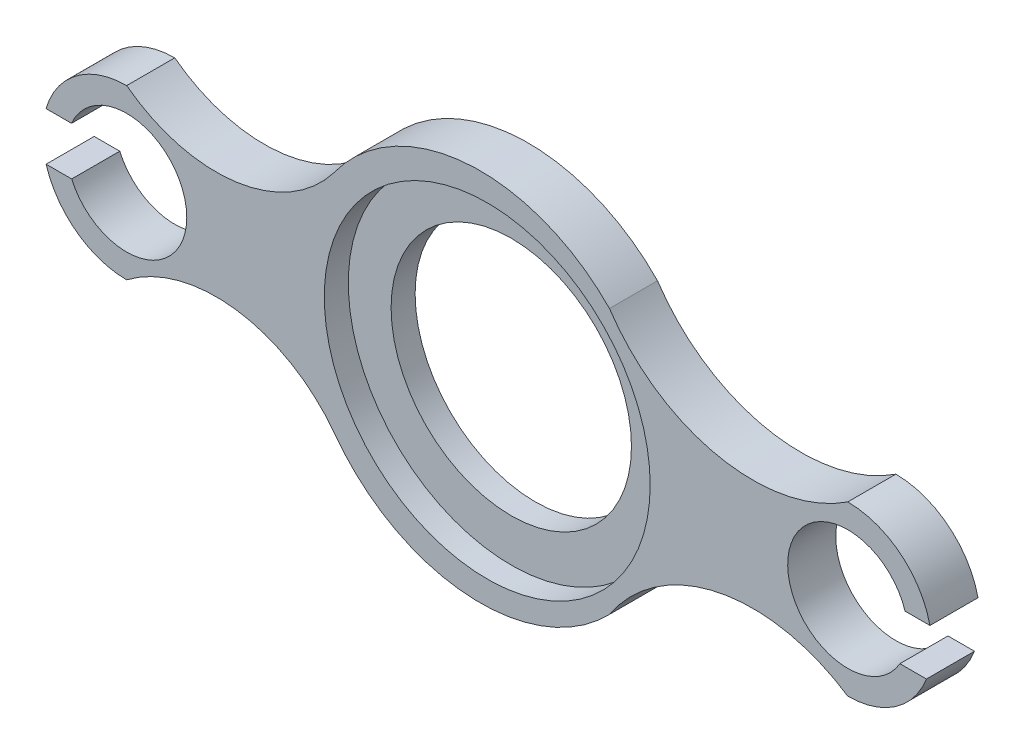
ISO-10303-21;
HEADER;
FILE_DESCRIPTION(('STEP AP214'),'2;1');
FILE_NAME('part.step','',(''),(''),'','','');
FILE_SCHEMA(('AUTOMOTIVE_DESIGN { 1 0 10303 214 1 1 1 1 }'));
ENDSEC;
DATA;
#1=APPLICATION_CONTEXT('core data for automotive mechanical design processes');
#2=APPLICATION_PROTOCOL_DEFINITION('international standard','automotive_design',2000,#1);
#3=PRODUCT_CONTEXT('',#1,'mechanical');
#4=PRODUCT('Part','Part','',(#3));
#5=PRODUCT_RELATED_PRODUCT_CATEGORY('part','',(#4));
#6=PRODUCT_DEFINITION_FORMATION('','',#4);
#7=PRODUCT_DEFINITION_CONTEXT('part definition',#1,'design');
#8=PRODUCT_DEFINITION('design','',#6,#7);
#9=PRODUCT_DEFINITION_SHAPE('','',#8);
#10=(LENGTH_UNIT() NAMED_UNIT(*) SI_UNIT(.MILLI.,.METRE.));
#11=(NAMED_UNIT(*) PLANE_ANGLE_UNIT() SI_UNIT($,.RADIAN.));
#12=(NAMED_UNIT(*) SI_UNIT($,.STERADIAN.) SOLID_ANGLE_UNIT());
#13=UNCERTAINTY_MEASURE_WITH_UNIT(LENGTH_MEASURE(1.E-05),#10,'distance_accuracy_value','');
#14=(GEOMETRIC_REPRESENTATION_CONTEXT(3) GLOBAL_UNCERTAINTY_ASSIGNED_CONTEXT((#13)) GLOBAL_UNIT_ASSIGNED_CONTEXT((#10,
#11,#12)) REPRESENTATION_CONTEXT('',''));
#15=CARTESIAN_POINT('',(0.,0.,0.));
#16=DIRECTION('',(0.,0.,1.));
#17=DIRECTION('',(1.,0.,0.));
#18=AXIS2_PLACEMENT_3D('',#15,#16,#17);
#19=CARTESIAN_POINT('',(150.,0.,20.));
#20=DIRECTION('',(0.,0.,-1.));
#21=DIRECTION('',(-1.,0.,0.));
#22=AXIS2_PLACEMENT_3D('',#19,#20,#21);
#23=CYLINDRICAL_SURFACE('',#22,35.);
#24=DIRECTION('',(0.,0.,-1.));
#25=VECTOR('',#24,1.);
#26=CARTESIAN_POINT('',(182.713610867677,-12.4426550220684,20.));
#27=LINE('',#26,#25);
#28=CARTESIAN_POINT('',(182.713610867677,-12.4426550220684,20.));
#29=VERTEX_POINT('',#28);
#30=CARTESIAN_POINT('',(182.713610867677,-12.4426550220684,0.));
#31=VERTEX_POINT('',#30);
#32=EDGE_CURVE('E57',#29,#31,#27,.T.);
#33=ORIENTED_EDGE('',*,*,#32,.F.);
#34=CARTESIAN_POINT('',(150.,0.,20.));
#35=DIRECTION('',(0.,0.,1.));
#36=DIRECTION('',(1.,0.,0.));
#37=AXIS2_PLACEMENT_3D('',#34,#35,#36);
#38=CIRCLE('',#37,35.);
#39=CARTESIAN_POINT('',(150.,-35.,20.));
#40=VERTEX_POINT('',#39);
#41=EDGE_CURVE('E181',#29,#40,#38,.F.);
#42=ORIENTED_EDGE('',*,*,#41,.T.);
#43=DIRECTION('',(0.,0.,-1.));
#44=VECTOR('',#43,1.);
#45=CARTESIAN_POINT('',(150.,-35.,20.));
#46=LINE('',#45,#44);
#47=CARTESIAN_POINT('',(150.,-35.,0.));
#48=VERTEX_POINT('',#47);
#49=EDGE_CURVE('E215',#40,#48,#46,.T.);
#50=ORIENTED_EDGE('',*,*,#49,.T.);
#51=CARTESIAN_POINT('',(150.,0.,0.));
#52=DIRECTION('',(0.,0.,1.));
#53=DIRECTION('',(1.,0.,0.));
#54=AXIS2_PLACEMENT_3D('',#51,#52,#53);
#55=CIRCLE('',#54,35.);
#56=EDGE_CURVE('E225',#31,#48,#55,.F.);
#57=ORIENTED_EDGE('',*,*,#56,.F.);
#58=EDGE_LOOP('',(#33,#42,#50,#57));
#59=FACE_BOUND('',#58,.T.);
#60=ADVANCED_FACE('F41',(#59),#23,.T.);
#61=CARTESIAN_POINT('',(-150.,0.,20.));
#62=DIRECTION('',(0.,0.,-1.));
#63=DIRECTION('',(-1.,0.,0.));
#64=AXIS2_PLACEMENT_3D('',#61,#62,#63);
#65=CYLINDRICAL_SURFACE('',#64,35.);
#66=CARTESIAN_POINT('',(-150.,0.,20.));
#67=DIRECTION('',(0.,0.,1.));
#68=DIRECTION('',(1.,0.,0.));
#69=AXIS2_PLACEMENT_3D('',#66,#67,#68);
#70=CIRCLE('',#69,35.);
#71=CARTESIAN_POINT('',(-183.518214525277,-10.0761746232141,20.));
#72=VERTEX_POINT('',#71);
#73=CARTESIAN_POINT('',(-150.,-35.,20.));
#74=VERTEX_POINT('',#73);
#75=EDGE_CURVE('E198',#72,#74,#70,.T.);
#76=ORIENTED_EDGE('',*,*,#75,.F.);
#77=DIRECTION('',(0.,0.,-1.));
#78=VECTOR('',#77,1.);
#79=CARTESIAN_POINT('',(-183.518214525277,-10.0761746232141,20.));
#80=LINE('',#79,#78);
#81=CARTESIAN_POINT('',(-183.518214525277,-10.0761746232141,0.));
#82=VERTEX_POINT('',#81);
#83=EDGE_CURVE('E320',#72,#82,#80,.T.);
#84=ORIENTED_EDGE('',*,*,#83,.T.);
#85=CARTESIAN_POINT('',(-150.,0.,0.));
#86=DIRECTION('',(0.,0.,1.));
#87=DIRECTION('',(1.,0.,0.));
#88=AXIS2_PLACEMENT_3D('',#85,#86,#87);
#89=CIRCLE('',#88,35.);
#90=CARTESIAN_POINT('',(-150.,-35.,0.));
#91=VERTEX_POINT('',#90);
#92=EDGE_CURVE('E241',#82,#91,#89,.T.);
#93=ORIENTED_EDGE('',*,*,#92,.T.);
#94=DIRECTION('',(0.,0.,-1.));
#95=VECTOR('',#94,1.);
#96=CARTESIAN_POINT('',(-150.,-35.,20.));
#97=LINE('',#96,#95);
#98=EDGE_CURVE('E268',#74,#91,#97,.T.);
#99=ORIENTED_EDGE('',*,*,#98,.F.);
#100=EDGE_LOOP('',(#76,#84,#93,#99));
#101=FACE_BOUND('',#100,.T.);
#102=ADVANCED_FACE('F360',(#101),#65,.T.);
#103=DIRECTION('',(0.,0.,-1.));
#104=VECTOR('',#103,1.);
#105=CARTESIAN_POINT('',(184.174354959304,7.55734497793156,20.));
#106=LINE('',#105,#104);
#107=CARTESIAN_POINT('',(184.174354959304,7.55734497793156,0.));
#108=VERTEX_POINT('',#107);
#109=CARTESIAN_POINT('',(184.174354959304,7.55734497793156,20.));
#110=VERTEX_POINT('',#109);
#111=EDGE_CURVE('E152',#108,#110,#106,.F.);
#112=ORIENTED_EDGE('',*,*,#111,.F.);
#113=CARTESIAN_POINT('',(150.,35.,0.));
#114=VERTEX_POINT('',#113);
#115=EDGE_CURVE('E226',#114,#108,#55,.F.);
#116=ORIENTED_EDGE('',*,*,#115,.F.);
#117=DIRECTION('',(0.,0.,-1.));
#118=VECTOR('',#117,1.);
#119=CARTESIAN_POINT('',(150.,35.,20.));
#120=LINE('',#119,#118);
#121=CARTESIAN_POINT('',(150.,35.,20.));
#122=VERTEX_POINT('',#121);
#123=EDGE_CURVE('E178',#122,#114,#120,.T.);
#124=ORIENTED_EDGE('',*,*,#123,.F.);
#125=EDGE_CURVE('E170',#122,#110,#38,.F.);
#126=ORIENTED_EDGE('',*,*,#125,.T.);
#127=EDGE_LOOP('',(#112,#116,#124,#126));
#128=FACE_BOUND('',#127,.T.);
#129=ADVANCED_FACE('F177',(#128),#23,.T.);
#130=CARTESIAN_POINT('',(110.479095687501,94.6346701084775,20.));
#131=DIRECTION('',(0.,0.,-1.));
#132=DIRECTION('',(-1.,0.,0.));
#133=AXIS2_PLACEMENT_3D('',#130,#131,#132);
#134=CYLINDRICAL_SURFACE('',#133,71.5415666352411);
#135=CARTESIAN_POINT('',(110.479095687501,94.6346701084775,0.));
#136=DIRECTION('',(0.,0.,1.));
#137=DIRECTION('',(1.,0.,0.));
#138=AXIS2_PLACEMENT_3D('',#135,#136,#137);
#139=CIRCLE('',#138,71.5415666352411);
#140=CARTESIAN_POINT('',(50.8444255790236,55.1137657959782,0.));
#141=VERTEX_POINT('',#140);
#142=EDGE_CURVE('E229',#141,#114,#139,.T.);
#143=ORIENTED_EDGE('',*,*,#142,.F.);
#144=DIRECTION('',(0.,0.,-1.));
#145=VECTOR('',#144,1.);
#146=CARTESIAN_POINT('',(50.8444255790236,55.1137657959782,20.));
#147=LINE('',#146,#145);
#148=CARTESIAN_POINT('',(50.8444255790236,55.1137657959782,20.));
#149=VERTEX_POINT('',#148);
#150=EDGE_CURVE('E279',#149,#141,#147,.T.);
#151=ORIENTED_EDGE('',*,*,#150,.F.);
#152=CARTESIAN_POINT('',(110.479095687501,94.6346701084775,20.));
#153=DIRECTION('',(0.,0.,1.));
#154=DIRECTION('',(1.,0.,0.));
#155=AXIS2_PLACEMENT_3D('',#152,#153,#154);
#156=CIRCLE('',#155,71.5415666352411);
#157=EDGE_CURVE('E180',#149,#122,#156,.T.);
#158=ORIENTED_EDGE('',*,*,#157,.T.);
#159=ORIENTED_EDGE('',*,*,#123,.T.);
#160=EDGE_LOOP('',(#143,#151,#158,#159));
#161=FACE_BOUND('',#160,.T.);
#162=ADVANCED_FACE('F396',(#161),#134,.F.);
#163=CARTESIAN_POINT('',(-2.95482048881246,2.85822903160819,20.));
#164=DIRECTION('',(0.,0.,-1.));
#165=DIRECTION('',(-1.,0.,0.));
#166=AXIS2_PLACEMENT_3D('',#163,#164,#165);
#167=CYLINDRICAL_SURFACE('',#166,75.);
#168=CARTESIAN_POINT('',(-2.95482048881246,2.85822903160819,0.));
#169=DIRECTION('',(0.,0.,1.));
#170=DIRECTION('',(1.,0.,0.));
#171=AXIS2_PLACEMENT_3D('',#168,#169,#170);
#172=CIRCLE('',#171,75.);
#173=CARTESIAN_POINT('',(-63.7727194883418,46.7465322715723,0.));
#174=VERTEX_POINT('',#173);
#175=EDGE_CURVE('E233',#174,#141,#172,.F.);
#176=ORIENTED_EDGE('',*,*,#175,.F.);
#177=DIRECTION('',(0.,0.,-1.));
#178=VECTOR('',#177,1.);
#179=CARTESIAN_POINT('',(-63.7727194883418,46.7465322715723,20.));
#180=LINE('',#179,#178);
#181=CARTESIAN_POINT('',(-63.7727194883418,46.7465322715723,20.));
#182=VERTEX_POINT('',#181);
#183=EDGE_CURVE('E276',#182,#174,#180,.T.);
#184=ORIENTED_EDGE('',*,*,#183,.F.);
#185=CARTESIAN_POINT('',(-2.95482048881246,2.85822903160819,20.));
#186=DIRECTION('',(0.,0.,1.));
#187=DIRECTION('',(1.,0.,0.));
#188=AXIS2_PLACEMENT_3D('',#185,#186,#187);
#189=CIRCLE('',#188,75.);
#190=EDGE_CURVE('E185',#182,#149,#189,.F.);
#191=ORIENTED_EDGE('',*,*,#190,.T.);
#192=ORIENTED_EDGE('',*,*,#150,.T.);
#193=EDGE_LOOP('',(#176,#184,#191,#192));
#194=FACE_BOUND('',#193,.T.);
#195=ADVANCED_FACE('F400',(#194),#167,.T.);
#196=CARTESIAN_POINT('',(-112.759625879957,83.9869063916154,20.));
#197=DIRECTION('',(0.,0.,-1.));
#198=DIRECTION('',(-1.,0.,0.));
#199=AXIS2_PLACEMENT_3D('',#196,#197,#198);
#200=CYLINDRICAL_SURFACE('',#199,61.5350506818809);
#201=CARTESIAN_POINT('',(-112.759625879957,83.9869063916154,0.));
#202=DIRECTION('',(0.,0.,1.));
#203=DIRECTION('',(1.,0.,0.));
#204=AXIS2_PLACEMENT_3D('',#201,#202,#203);
#205=CIRCLE('',#204,61.5350506818809);
#206=CARTESIAN_POINT('',(-150.,35.,0.));
#207=VERTEX_POINT('',#206);
#208=EDGE_CURVE('E237',#174,#207,#205,.F.);
#209=ORIENTED_EDGE('',*,*,#208,.T.);
#210=DIRECTION('',(0.,0.,-1.));
#211=VECTOR('',#210,1.);
#212=CARTESIAN_POINT('',(-150.,35.,20.));
#213=LINE('',#212,#211);
#214=CARTESIAN_POINT('',(-150.,35.,20.));
#215=VERTEX_POINT('',#214);
#216=EDGE_CURVE('E272',#215,#207,#213,.T.);
#217=ORIENTED_EDGE('',*,*,#216,.F.);
#218=CARTESIAN_POINT('',(-112.759625879957,83.9869063916154,20.));
#219=DIRECTION('',(0.,0.,1.));
#220=DIRECTION('',(1.,0.,0.));
#221=AXIS2_PLACEMENT_3D('',#218,#219,#220);
#222=CIRCLE('',#221,61.5350506818809);
#223=EDGE_CURVE('E194',#182,#215,#222,.F.);
#224=ORIENTED_EDGE('',*,*,#223,.F.);
#225=ORIENTED_EDGE('',*,*,#183,.T.);
#226=EDGE_LOOP('',(#209,#217,#224,#225));
#227=FACE_BOUND('',#226,.T.);
#228=ADVANCED_FACE('F405',(#227),#200,.F.);
#229=CARTESIAN_POINT('',(-183.56363642234,9.92382537678589,0.));
#230=VERTEX_POINT('',#229);
#231=EDGE_CURVE('E242',#207,#230,#89,.T.);
#232=ORIENTED_EDGE('',*,*,#231,.T.);
#233=DIRECTION('',(0.,0.,-1.));
#234=VECTOR('',#233,1.);
#235=CARTESIAN_POINT('',(-183.56363642234,9.92382537678589,20.));
#236=LINE('',#235,#234);
#237=CARTESIAN_POINT('',(-183.56363642234,9.92382537678589,20.));
#238=VERTEX_POINT('',#237);
#239=EDGE_CURVE('E316',#230,#238,#236,.F.);
#240=ORIENTED_EDGE('',*,*,#239,.T.);
#241=EDGE_CURVE('E199',#215,#238,#70,.T.);
#242=ORIENTED_EDGE('',*,*,#241,.F.);
#243=ORIENTED_EDGE('',*,*,#216,.T.);
#244=EDGE_LOOP('',(#232,#240,#242,#243));
#245=FACE_BOUND('',#244,.T.);
#246=ADVANCED_FACE('F352',(#245),#65,.T.);
#247=CARTESIAN_POINT('',(-112.759625879957,-83.9869063916154,20.));
#248=DIRECTION('',(0.,0.,-1.));
#249=DIRECTION('',(-1.,0.,0.));
#250=AXIS2_PLACEMENT_3D('',#247,#248,#249);
#251=CYLINDRICAL_SURFACE('',#250,61.5350506818809);
#252=CARTESIAN_POINT('',(-112.759625879957,-83.9869063916154,0.));
#253=DIRECTION('',(0.,0.,1.));
#254=DIRECTION('',(1.,0.,0.));
#255=AXIS2_PLACEMENT_3D('',#252,#253,#254);
#256=CIRCLE('',#255,61.5350506818809);
#257=CARTESIAN_POINT('',(-63.7727194883418,-46.7465322715722,0.));
#258=VERTEX_POINT('',#257);
#259=EDGE_CURVE('E246',#258,#91,#256,.T.);
#260=ORIENTED_EDGE('',*,*,#259,.F.);
#261=DIRECTION('',(0.,0.,-1.));
#262=VECTOR('',#261,1.);
#263=CARTESIAN_POINT('',(-63.7727194883418,-46.7465322715722,20.));
#264=LINE('',#263,#262);
#265=CARTESIAN_POINT('',(-63.7727194883418,-46.7465322715722,20.));
#266=VERTEX_POINT('',#265);
#267=EDGE_CURVE('E265',#266,#258,#264,.T.);
#268=ORIENTED_EDGE('',*,*,#267,.F.);
#269=CARTESIAN_POINT('',(-112.759625879957,-83.9869063916154,20.));
#270=DIRECTION('',(0.,0.,1.));
#271=DIRECTION('',(1.,0.,0.));
#272=AXIS2_PLACEMENT_3D('',#269,#270,#271);
#273=CIRCLE('',#272,61.5350506818809);
#274=EDGE_CURVE('E203',#266,#74,#273,.T.);
#275=ORIENTED_EDGE('',*,*,#274,.T.);
#276=ORIENTED_EDGE('',*,*,#98,.T.);
#277=EDGE_LOOP('',(#260,#268,#275,#276));
#278=FACE_BOUND('',#277,.T.);
#279=ADVANCED_FACE('F368',(#278),#251,.F.);
#280=CARTESIAN_POINT('',(-2.95482048881246,-2.85822903160813,20.));
#281=DIRECTION('',(0.,0.,-1.));
#282=DIRECTION('',(-1.,0.,0.));
#283=AXIS2_PLACEMENT_3D('',#280,#281,#282);
#284=CYLINDRICAL_SURFACE('',#283,75.);
#285=CARTESIAN_POINT('',(-2.95482048881246,-2.85822903160813,0.));
#286=DIRECTION('',(0.,0.,1.));
#287=DIRECTION('',(1.,0.,0.));
#288=AXIS2_PLACEMENT_3D('',#285,#286,#287);
#289=CIRCLE('',#288,75.);
#290=CARTESIAN_POINT('',(50.8444255790236,-55.1137657959782,0.));
#291=VERTEX_POINT('',#290);
#292=EDGE_CURVE('E250',#258,#291,#289,.T.);
#293=ORIENTED_EDGE('',*,*,#292,.T.);
#294=DIRECTION('',(0.,0.,-1.));
#295=VECTOR('',#294,1.);
#296=CARTESIAN_POINT('',(50.8444255790236,-55.1137657959782,20.));
#297=LINE('',#296,#295);
#298=CARTESIAN_POINT('',(50.8444255790236,-55.1137657959782,20.));
#299=VERTEX_POINT('',#298);
#300=EDGE_CURVE('E261',#299,#291,#297,.T.);
#301=ORIENTED_EDGE('',*,*,#300,.F.);
#302=CARTESIAN_POINT('',(-2.95482048881246,-2.85822903160813,20.));
#303=DIRECTION('',(0.,0.,1.));
#304=DIRECTION('',(1.,0.,0.));
#305=AXIS2_PLACEMENT_3D('',#302,#303,#304);
#306=CIRCLE('',#305,75.);
#307=EDGE_CURVE('E207',#266,#299,#306,.T.);
#308=ORIENTED_EDGE('',*,*,#307,.F.);
#309=ORIENTED_EDGE('',*,*,#267,.T.);
#310=EDGE_LOOP('',(#293,#301,#308,#309));
#311=FACE_BOUND('',#310,.T.);
#312=ADVANCED_FACE('F371',(#311),#284,.T.);
#313=CARTESIAN_POINT('',(-150.,0.,20.));
#314=DIRECTION('',(0.,0.,-1.));
#315=DIRECTION('',(-1.,0.,0.));
#316=AXIS2_PLACEMENT_3D('',#313,#314,#315);
#317=CYLINDRICAL_SURFACE('',#316,25.);
#318=DIRECTION('',(0.,0.,1.));
#319=VECTOR('',#318,1.);
#320=CARTESIAN_POINT('',(-172.879482183006,-10.0761746232141,0.));
#321=LINE('',#320,#319);
#322=CARTESIAN_POINT('',(-172.879482183006,-10.0761746232141,0.));
#323=VERTEX_POINT('',#322);
#324=CARTESIAN_POINT('',(-172.879482183006,-10.0761746232141,20.));
#325=VERTEX_POINT('',#324);
#326=EDGE_CURVE('E309',#323,#325,#321,.T.);
#327=ORIENTED_EDGE('',*,*,#326,.T.);
#328=CARTESIAN_POINT('',(-150.,0.,20.));
#329=DIRECTION('',(0.,0.,1.));
#330=DIRECTION('',(1.,0.,0.));
#331=AXIS2_PLACEMENT_3D('',#328,#329,#330);
#332=CIRCLE('',#331,25.);
#333=CARTESIAN_POINT('',(-172.945973282715,9.92382537678589,20.));
#334=VERTEX_POINT('',#333);
#335=EDGE_CURVE('E187',#325,#334,#332,.T.);
#336=ORIENTED_EDGE('',*,*,#335,.T.);
#337=DIRECTION('',(0.,0.,-1.));
#338=VECTOR('',#337,1.);
#339=CARTESIAN_POINT('',(-172.945973282715,9.92382537678589,20.));
#340=LINE('',#339,#338);
#341=CARTESIAN_POINT('',(-172.945973282715,9.92382537678589,0.));
#342=VERTEX_POINT('',#341);
#343=EDGE_CURVE('E313',#342,#334,#340,.F.);
#344=ORIENTED_EDGE('',*,*,#343,.F.);
#345=CARTESIAN_POINT('',(-150.,0.,0.));
#346=DIRECTION('',(0.,0.,1.));
#347=DIRECTION('',(1.,0.,0.));
#348=AXIS2_PLACEMENT_3D('',#345,#346,#347);
#349=CIRCLE('',#348,25.);
#350=EDGE_CURVE('E220',#323,#342,#349,.T.);
#351=ORIENTED_EDGE('',*,*,#350,.F.);
#352=EDGE_LOOP('',(#327,#336,#344,#351));
#353=FACE_BOUND('',#352,.T.);
#354=ADVANCED_FACE('F344',(#353),#317,.F.);
#355=CARTESIAN_POINT('',(150.,0.,20.));
#356=DIRECTION('',(0.,0.,-1.));
#357=DIRECTION('',(-1.,0.,0.));
#358=AXIS2_PLACEMENT_3D('',#355,#356,#357);
#359=CYLINDRICAL_SURFACE('',#358,25.);
#360=DIRECTION('',(0.,0.,-1.));
#361=VECTOR('',#360,1.);
#362=CARTESIAN_POINT('',(171.683642129536,-12.4426550220684,20.));
#363=LINE('',#362,#361);
#364=CARTESIAN_POINT('',(171.683642129536,-12.4426550220684,0.));
#365=VERTEX_POINT('',#364);
#366=CARTESIAN_POINT('',(171.683642129536,-12.4426550220684,20.));
#367=VERTEX_POINT('',#366);
#368=EDGE_CURVE('E161',#365,#367,#363,.F.);
#369=ORIENTED_EDGE('',*,*,#368,.F.);
#370=CARTESIAN_POINT('',(150.,0.,0.));
#371=DIRECTION('',(0.,0.,1.));
#372=DIRECTION('',(1.,0.,0.));
#373=AXIS2_PLACEMENT_3D('',#370,#371,#372);
#374=CIRCLE('',#373,25.);
#375=CARTESIAN_POINT('',(173.830370053453,7.55734497793156,0.));
#376=VERTEX_POINT('',#375);
#377=EDGE_CURVE('E216',#376,#365,#374,.T.);
#378=ORIENTED_EDGE('',*,*,#377,.F.);
#379=DIRECTION('',(0.,0.,-1.));
#380=VECTOR('',#379,1.);
#381=CARTESIAN_POINT('',(173.830370053453,7.55734497793156,20.));
#382=LINE('',#381,#380);
#383=CARTESIAN_POINT('',(173.830370053453,7.55734497793156,20.));
#384=VERTEX_POINT('',#383);
#385=EDGE_CURVE('E64',#384,#376,#382,.T.);
#386=ORIENTED_EDGE('',*,*,#385,.F.);
#387=CARTESIAN_POINT('',(150.,0.,20.));
#388=DIRECTION('',(0.,0.,1.));
#389=DIRECTION('',(1.,0.,0.));
#390=AXIS2_PLACEMENT_3D('',#387,#388,#389);
#391=CIRCLE('',#390,25.);
#392=EDGE_CURVE('E173',#384,#367,#391,.T.);
#393=ORIENTED_EDGE('',*,*,#392,.T.);
#394=EDGE_LOOP('',(#369,#378,#386,#393));
#395=FACE_BOUND('',#394,.T.);
#396=ADVANCED_FACE('F296',(#395),#359,.F.);
#397=CARTESIAN_POINT('',(110.479095687501,-94.6346701084774,20.));
#398=DIRECTION('',(0.,0.,-1.));
#399=DIRECTION('',(-1.,0.,0.));
#400=AXIS2_PLACEMENT_3D('',#397,#398,#399);
#401=CYLINDRICAL_SURFACE('',#400,71.5415666352411);
#402=CARTESIAN_POINT('',(110.479095687501,-94.6346701084774,0.));
#403=DIRECTION('',(0.,0.,1.));
#404=DIRECTION('',(1.,0.,0.));
#405=AXIS2_PLACEMENT_3D('',#402,#403,#404);
#406=CIRCLE('',#405,71.5415666352411);
#407=EDGE_CURVE('E254',#291,#48,#406,.F.);
#408=ORIENTED_EDGE('',*,*,#407,.T.);
#409=ORIENTED_EDGE('',*,*,#49,.F.);
#410=CARTESIAN_POINT('',(110.479095687501,-94.6346701084774,20.));
#411=DIRECTION('',(0.,0.,1.));
#412=DIRECTION('',(1.,0.,0.));
#413=AXIS2_PLACEMENT_3D('',#410,#411,#412);
#414=CIRCLE('',#413,71.5415666352411);
#415=EDGE_CURVE('E211',#299,#40,#414,.F.);
#416=ORIENTED_EDGE('',*,*,#415,.F.);
#417=ORIENTED_EDGE('',*,*,#300,.T.);
#418=EDGE_LOOP('',(#408,#409,#416,#417));
#419=FACE_BOUND('',#418,.T.);
#420=ADVANCED_FACE('F373',(#419),#401,.F.);
#421=CARTESIAN_POINT('',(0.,0.,20.));
#422=DIRECTION('',(0.,0.,1.));
#423=DIRECTION('',(1.,0.,0.));
#424=AXIS2_PLACEMENT_3D('',#421,#422,#423);
#425=PLANE('',#424);
#426=DIRECTION('',(1.,0.,0.));
#427=VECTOR('',#426,1.);
#428=CARTESIAN_POINT('',(169.676339456919,-12.4426550220684,20.));
#429=LINE('',#428,#427);
#430=EDGE_CURVE('E175',#367,#29,#429,.T.);
#431=ORIENTED_EDGE('',*,*,#430,.F.);
#432=ORIENTED_EDGE('',*,*,#392,.F.);
#433=DIRECTION('',(-1.,0.,0.));
#434=VECTOR('',#433,1.);
#435=CARTESIAN_POINT('',(169.676339456919,7.55734497793156,20.));
#436=LINE('',#435,#434);
#437=EDGE_CURVE('E155',#110,#384,#436,.T.);
#438=ORIENTED_EDGE('',*,*,#437,.F.);
#439=ORIENTED_EDGE('',*,*,#125,.F.);
#440=ORIENTED_EDGE('',*,*,#157,.F.);
#441=ORIENTED_EDGE('',*,*,#190,.F.);
#442=ORIENTED_EDGE('',*,*,#223,.T.);
#443=ORIENTED_EDGE('',*,*,#241,.T.);
#444=DIRECTION('',(-1.,0.,0.));
#445=VECTOR('',#444,1.);
#446=CARTESIAN_POINT('',(-187.960476758591,9.92382537678589,20.));
#447=LINE('',#446,#445);
#448=EDGE_CURVE('E300',#334,#238,#447,.T.);
#449=ORIENTED_EDGE('',*,*,#448,.F.);
#450=ORIENTED_EDGE('',*,*,#335,.F.);
#451=DIRECTION('',(1.,0.,0.));
#452=VECTOR('',#451,1.);
#453=CARTESIAN_POINT('',(-187.960476758591,-10.0761746232141,20.));
#454=LINE('',#453,#452);
#455=EDGE_CURVE('E306',#72,#325,#454,.T.);
#456=ORIENTED_EDGE('',*,*,#455,.F.);
#457=ORIENTED_EDGE('',*,*,#75,.T.);
#458=ORIENTED_EDGE('',*,*,#274,.F.);
#459=ORIENTED_EDGE('',*,*,#307,.T.);
#460=ORIENTED_EDGE('',*,*,#415,.T.);
#461=ORIENTED_EDGE('',*,*,#41,.F.);
#462=EDGE_LOOP('',(#431,#432,#438,#439,#440,#441,#442,#443,#449,#450,#456,#457,#458,#459,#460,#461));
#463=FACE_BOUND('',#462,.T.);
#464=CARTESIAN_POINT('',(0.,0.,20.));
#465=DIRECTION('',(0.,0.,1.));
#466=DIRECTION('',(1.,0.,0.));
#467=AXIS2_PLACEMENT_3D('',#464,#465,#466);
#468=CIRCLE('',#467,67.8);
#469=CARTESIAN_POINT('',(67.8,0.,20.));
#470=VERTEX_POINT('',#469);
#471=EDGE_CURVE('E329',#470,#470,#468,.T.);
#472=ORIENTED_EDGE('',*,*,#471,.F.);
#473=EDGE_LOOP('',(#472));
#474=FACE_BOUND('',#473,.T.);
#475=ADVANCED_FACE('F167',(#463,#474),#425,.T.);
#476=CARTESIAN_POINT('',(0.,0.,0.));
#477=DIRECTION('',(0.,0.,1.));
#478=DIRECTION('',(1.,0.,0.));
#479=AXIS2_PLACEMENT_3D('',#476,#477,#478);
#480=PLANE('',#479);
#481=CARTESIAN_POINT('',(0.,0.,0.));
#482=DIRECTION('',(0.,0.,1.));
#483=DIRECTION('',(1.,0.,0.));
#484=AXIS2_PLACEMENT_3D('',#481,#482,#483);
#485=CIRCLE('',#484,50.);
#486=CARTESIAN_POINT('',(50.,0.,0.));
#487=VERTEX_POINT('',#486);
#488=EDGE_CURVE('E325',#487,#487,#485,.T.);
#489=ORIENTED_EDGE('',*,*,#488,.T.);
#490=EDGE_LOOP('',(#489));
#491=FACE_BOUND('',#490,.T.);
#492=ORIENTED_EDGE('',*,*,#377,.T.);
#493=DIRECTION('',(1.,0.,0.));
#494=VECTOR('',#493,1.);
#495=CARTESIAN_POINT('',(0.,-12.4426550220684,0.));
#496=LINE('',#495,#494);
#497=EDGE_CURVE('E11',#365,#31,#496,.T.);
#498=ORIENTED_EDGE('',*,*,#497,.T.);
#499=ORIENTED_EDGE('',*,*,#56,.T.);
#500=ORIENTED_EDGE('',*,*,#407,.F.);
#501=ORIENTED_EDGE('',*,*,#292,.F.);
#502=ORIENTED_EDGE('',*,*,#259,.T.);
#503=ORIENTED_EDGE('',*,*,#92,.F.);
#504=DIRECTION('',(1.,0.,0.));
#505=VECTOR('',#504,1.);
#506=CARTESIAN_POINT('',(0.,-10.0761746232141,0.));
#507=LINE('',#506,#505);
#508=EDGE_CURVE('E288',#82,#323,#507,.T.);
#509=ORIENTED_EDGE('',*,*,#508,.T.);
#510=ORIENTED_EDGE('',*,*,#350,.T.);
#511=DIRECTION('',(-1.,0.,0.));
#512=VECTOR('',#511,1.);
#513=CARTESIAN_POINT('',(0.,9.92382537678589,0.));
#514=LINE('',#513,#512);
#515=EDGE_CURVE('E284',#342,#230,#514,.T.);
#516=ORIENTED_EDGE('',*,*,#515,.T.);
#517=ORIENTED_EDGE('',*,*,#231,.F.);
#518=ORIENTED_EDGE('',*,*,#208,.F.);
#519=ORIENTED_EDGE('',*,*,#175,.T.);
#520=ORIENTED_EDGE('',*,*,#142,.T.);
#521=ORIENTED_EDGE('',*,*,#115,.T.);
#522=DIRECTION('',(-1.,0.,0.));
#523=VECTOR('',#522,1.);
#524=CARTESIAN_POINT('',(0.,7.55734497793156,0.));
#525=LINE('',#524,#523);
#526=EDGE_CURVE('E50',#108,#376,#525,.T.);
#527=ORIENTED_EDGE('',*,*,#526,.T.);
#528=EDGE_LOOP('',(#492,#498,#499,#500,#501,#502,#503,#509,#510,#516,#517,#518,#519,#520,#521,#527));
#529=FACE_BOUND('',#528,.T.);
#530=ADVANCED_FACE('F43',(#491,#529),#480,.F.);
#531=CARTESIAN_POINT('',(0.,0.,10.));
#532=DIRECTION('',(0.,0.,1.));
#533=DIRECTION('',(1.,0.,0.));
#534=AXIS2_PLACEMENT_3D('',#531,#532,#533);
#535=CYLINDRICAL_SURFACE('',#534,67.8);
#536=CARTESIAN_POINT('',(0.,0.,10.));
#537=DIRECTION('',(0.,0.,1.));
#538=DIRECTION('',(1.,0.,0.));
#539=AXIS2_PLACEMENT_3D('',#536,#537,#538);
#540=CIRCLE('',#539,67.8);
#541=CARTESIAN_POINT('',(67.8,0.,10.));
#542=VERTEX_POINT('',#541);
#543=EDGE_CURVE('E221',#542,#542,#540,.T.);
#544=ORIENTED_EDGE('',*,*,#543,.F.);
#545=EDGE_LOOP('',(#544));
#546=FACE_BOUND('',#545,.T.);
#547=ORIENTED_EDGE('',*,*,#471,.T.);
#548=EDGE_LOOP('',(#547));
#549=FACE_BOUND('',#548,.T.);
#550=ADVANCED_FACE('F422',(#546,#549),#535,.F.);
#551=CARTESIAN_POINT('',(0.,0.,10.));
#552=DIRECTION('',(0.,0.,1.));
#553=DIRECTION('',(1.,0.,0.));
#554=AXIS2_PLACEMENT_3D('',#551,#552,#553);
#555=PLANE('',#554);
#556=CARTESIAN_POINT('',(0.,0.,10.));
#557=DIRECTION('',(0.,0.,1.));
#558=DIRECTION('',(1.,0.,0.));
#559=AXIS2_PLACEMENT_3D('',#556,#557,#558);
#560=CIRCLE('',#559,50.);
#561=CARTESIAN_POINT('',(50.,0.,10.));
#562=VERTEX_POINT('',#561);
#563=EDGE_CURVE('E324',#562,#562,#560,.T.);
#564=ORIENTED_EDGE('',*,*,#563,.F.);
#565=EDGE_LOOP('',(#564));
#566=FACE_BOUND('',#565,.T.);
#567=ORIENTED_EDGE('',*,*,#543,.T.);
#568=EDGE_LOOP('',(#567));
#569=FACE_BOUND('',#568,.T.);
#570=ADVANCED_FACE('F425',(#566,#569),#555,.T.);
#571=CARTESIAN_POINT('',(0.,0.,0.));
#572=DIRECTION('',(0.,0.,1.));
#573=DIRECTION('',(1.,0.,0.));
#574=AXIS2_PLACEMENT_3D('',#571,#572,#573);
#575=CYLINDRICAL_SURFACE('',#574,50.);
#576=ORIENTED_EDGE('',*,*,#488,.F.);
#577=EDGE_LOOP('',(#576));
#578=FACE_BOUND('',#577,.T.);
#579=ORIENTED_EDGE('',*,*,#563,.T.);
#580=EDGE_LOOP('',(#579));
#581=FACE_BOUND('',#580,.T.);
#582=ADVANCED_FACE('F429',(#578,#581),#575,.F.);
#583=CARTESIAN_POINT('',(-187.960476758591,9.92382537678589,0.));
#584=DIRECTION('',(0.,1.,0.));
#585=DIRECTION('',(0.,0.,1.));
#586=AXIS2_PLACEMENT_3D('',#583,#584,#585);
#587=PLANE('',#586);
#588=ORIENTED_EDGE('',*,*,#515,.F.);
#589=ORIENTED_EDGE('',*,*,#343,.T.);
#590=ORIENTED_EDGE('',*,*,#448,.T.);
#591=ORIENTED_EDGE('',*,*,#239,.F.);
#592=EDGE_LOOP('',(#588,#589,#590,#591));
#593=FACE_BOUND('',#592,.T.);
#594=ADVANCED_FACE('F350',(#593),#587,.F.);
#595=CARTESIAN_POINT('',(-187.960476758591,-10.0761746232141,0.));
#596=DIRECTION('',(0.,-1.,0.));
#597=DIRECTION('',(0.,0.,-1.));
#598=AXIS2_PLACEMENT_3D('',#595,#596,#597);
#599=PLANE('',#598);
#600=ORIENTED_EDGE('',*,*,#455,.T.);
#601=ORIENTED_EDGE('',*,*,#326,.F.);
#602=ORIENTED_EDGE('',*,*,#508,.F.);
#603=ORIENTED_EDGE('',*,*,#83,.F.);
#604=EDGE_LOOP('',(#600,#601,#602,#603));
#605=FACE_BOUND('',#604,.T.);
#606=ADVANCED_FACE('F358',(#605),#599,.F.);
#607=CARTESIAN_POINT('',(169.676339456919,7.55734497793156,0.));
#608=DIRECTION('',(0.,1.,0.));
#609=DIRECTION('',(0.,0.,1.));
#610=AXIS2_PLACEMENT_3D('',#607,#608,#609);
#611=PLANE('',#610);
#612=ORIENTED_EDGE('',*,*,#111,.T.);
#613=ORIENTED_EDGE('',*,*,#437,.T.);
#614=ORIENTED_EDGE('',*,*,#385,.T.);
#615=ORIENTED_EDGE('',*,*,#526,.F.);
#616=EDGE_LOOP('',(#612,#613,#614,#615));
#617=FACE_BOUND('',#616,.T.);
#618=ADVANCED_FACE('F154',(#617),#611,.F.);
#619=CARTESIAN_POINT('',(169.676339456919,-12.4426550220684,0.));
#620=DIRECTION('',(0.,-1.,0.));
#621=DIRECTION('',(0.,0.,-1.));
#622=AXIS2_PLACEMENT_3D('',#619,#620,#621);
#623=PLANE('',#622);
#624=ORIENTED_EDGE('',*,*,#32,.T.);
#625=ORIENTED_EDGE('',*,*,#497,.F.);
#626=ORIENTED_EDGE('',*,*,#368,.T.);
#627=ORIENTED_EDGE('',*,*,#430,.T.);
#628=EDGE_LOOP('',(#624,#625,#626,#627));
#629=FACE_BOUND('',#628,.T.);
#630=ADVANCED_FACE('F380',(#629),#623,.F.);
#631=CLOSED_SHELL('',(#60,#102,#129,#162,#195,#228,#246,#279,#312,#354,#396,#420,#475,#530,#550,
#570,#582,#594,#606,#618,#630));
#632=MANIFOLD_SOLID_BREP('B2',#631);
#633=ADVANCED_BREP_SHAPE_REPRESENTATION('',(#18,#632),#14);
#634=SHAPE_DEFINITION_REPRESENTATION(#9,#633);
ENDSEC;
END-ISO-10303-21;
